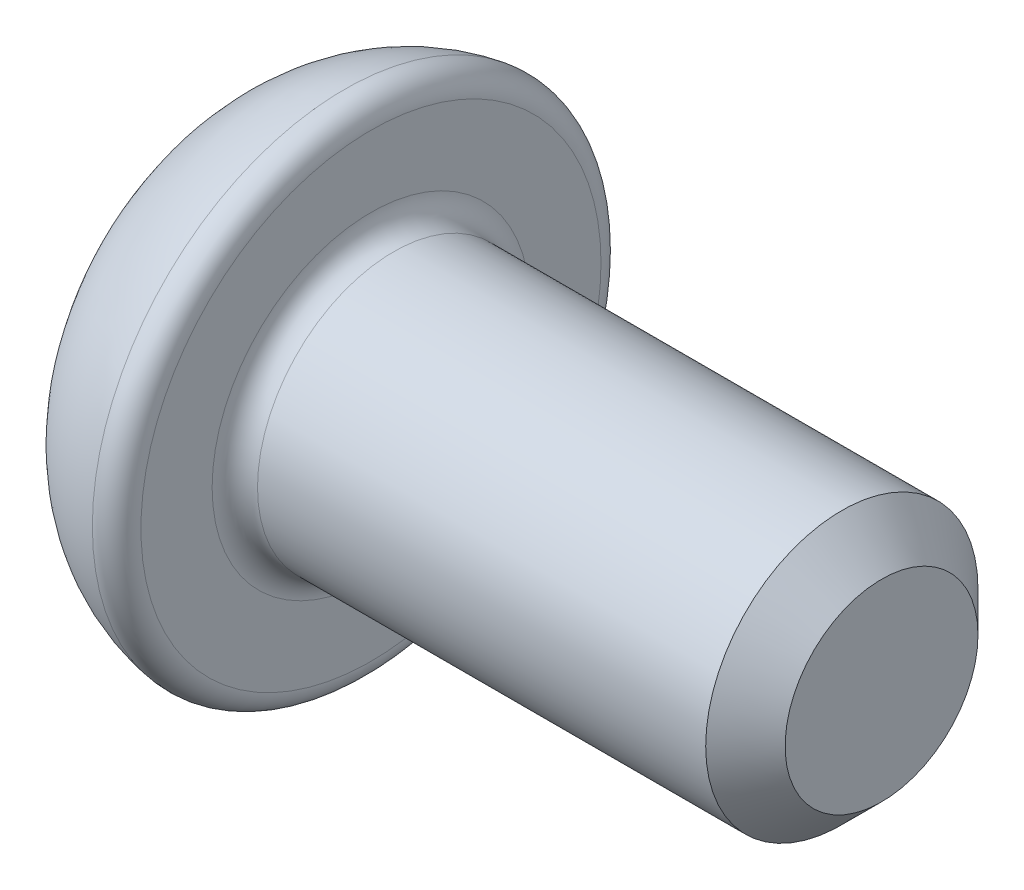
ISO-10303-21;
HEADER;
FILE_DESCRIPTION(('STEP AP214'),'2;1');
FILE_NAME('part.step','',(''),(''),'','','');
FILE_SCHEMA(('AUTOMOTIVE_DESIGN { 1 0 10303 214 1 1 1 1 }'));
ENDSEC;
DATA;
#1=APPLICATION_CONTEXT('core data for automotive mechanical design processes');
#2=APPLICATION_PROTOCOL_DEFINITION('international standard','automotive_design',2000,#1);
#3=PRODUCT_CONTEXT('',#1,'mechanical');
#4=PRODUCT('Part','Part','',(#3));
#5=PRODUCT_RELATED_PRODUCT_CATEGORY('part','',(#4));
#6=PRODUCT_DEFINITION_FORMATION('','',#4);
#7=PRODUCT_DEFINITION_CONTEXT('part definition',#1,'design');
#8=PRODUCT_DEFINITION('design','',#6,#7);
#9=PRODUCT_DEFINITION_SHAPE('','',#8);
#10=(LENGTH_UNIT() NAMED_UNIT(*) SI_UNIT(.MILLI.,.METRE.));
#11=(NAMED_UNIT(*) PLANE_ANGLE_UNIT() SI_UNIT($,.RADIAN.));
#12=(NAMED_UNIT(*) SI_UNIT($,.STERADIAN.) SOLID_ANGLE_UNIT());
#13=UNCERTAINTY_MEASURE_WITH_UNIT(LENGTH_MEASURE(1.E-05),#10,'distance_accuracy_value','');
#14=(GEOMETRIC_REPRESENTATION_CONTEXT(3) GLOBAL_UNCERTAINTY_ASSIGNED_CONTEXT((#13)) GLOBAL_UNIT_ASSIGNED_CONTEXT((#10,
#11,#12)) REPRESENTATION_CONTEXT('',''));
#15=CARTESIAN_POINT('',(0.,0.,0.));
#16=DIRECTION('',(0.,0.,1.));
#17=DIRECTION('',(1.,0.,0.));
#18=AXIS2_PLACEMENT_3D('',#15,#16,#17);
#19=CARTESIAN_POINT('',(1.5,0.,0.));
#20=DIRECTION('',(1.,0.,0.));
#21=DIRECTION('',(0.,0.,-1.));
#22=AXIS2_PLACEMENT_3D('',#19,#20,#21);
#23=DEGENERATE_TOROIDAL_SURFACE('',#22,0.742857779384793,1.5,.T.);
#24=CARTESIAN_POINT('',(0.00507482698011568,-0.866140873838277,-0.000200000000000182));
#25=CARTESIAN_POINT('',(0.00359045454716698,-0.848096714415208,0.0310534009006274));
#26=CARTESIAN_POINT('',(0.00256712460489067,-0.830046186840496,0.0623178317634519));
#27=CARTESIAN_POINT('',(0.00113644894011085,-0.793941421995864,0.124853118869681));
#28=CARTESIAN_POINT('',(0.000729006787376216,-0.775887185749428,0.156123973340361));
#29=CARTESIAN_POINT('',(0.000223771191370331,-0.739781114546436,0.218661523125641));
#30=CARTESIAN_POINT('',(0.000125930777252115,-0.721729279641151,0.249928218351441));
#31=CARTESIAN_POINT('',(2.25448094797791E-05,-0.685624647439826,0.312463275712722));
#32=CARTESIAN_POINT('',(1.70036735102103E-05,-0.667571850139078,0.34373163785636));
#33=CARTESIAN_POINT('',(1.70036735104579E-05,-0.631466255537582,0.406268362143637));
#34=CARTESIAN_POINT('',(2.25448094802742E-05,-0.613413458236834,0.437536724287275));
#35=CARTESIAN_POINT('',(0.000125930777251618,-0.577308826035509,0.500071781648556));
#36=CARTESIAN_POINT('',(0.000223771191368596,-0.559256991130224,0.531338476874356));
#37=CARTESIAN_POINT('',(0.000729006787378057,-0.523150919927233,0.593876026659636));
#38=CARTESIAN_POINT('',(0.0011364489401175,-0.505096683680796,0.625146881130316));
#39=CARTESIAN_POINT('',(0.00256712460488402,-0.468991918836165,0.687682168236544));
#40=CARTESIAN_POINT('',(0.0035904545471422,-0.450941391261452,0.718946599099369));
#41=CARTESIAN_POINT('',(0.00507482698004681,-0.432897231838383,0.750199999999997));
#42=B_SPLINE_CURVE_WITH_KNOTS('',3,(#24,#25,#26,#27,#28,#29,#30,#31,#32,#33,#34,#35,#36,#37,#38,
#39,#40,#41),.UNSPECIFIED.,.F.,.F.,(4,2,2,2,2,2,2,2,4),(0.,0.108344917548004,0.216672869654924,
0.324984386131675,0.433301086665634,0.541617787199592,0.649929303676343,0.758257255783262,
0.866602173331265),.UNSPECIFIED.);
#43=CARTESIAN_POINT('',(0.00506530701247117,-0.866025403784439,0.));
#44=VERTEX_POINT('',#43);
#45=CARTESIAN_POINT('',(0.0050653070118024,-0.433012701892483,0.75));
#46=VERTEX_POINT('',#45);
#47=EDGE_CURVE('E11',#44,#46,#42,.T.);
#48=ORIENTED_EDGE('',*,*,#47,.F.);
#49=CARTESIAN_POINT('',(0.00507482698011564,-0.432897231838381,-0.7502));
#50=CARTESIAN_POINT('',(0.00359045454716716,-0.45094139126145,-0.718946599099373));
#51=CARTESIAN_POINT('',(0.00256712460489088,-0.468991918836162,-0.687682168236548));
#52=CARTESIAN_POINT('',(0.00113644894011098,-0.505096683680794,-0.625146881130319));
#53=CARTESIAN_POINT('',(0.000729006787376246,-0.52315091992723,-0.593876026659639));
#54=CARTESIAN_POINT('',(0.000223771191370313,-0.559256991130222,-0.531338476874359));
#55=CARTESIAN_POINT('',(0.00012593077725215,-0.577308826035507,-0.500071781648559));
#56=CARTESIAN_POINT('',(2.25448094798608E-05,-0.613413458236832,-0.437536724287278));
#57=CARTESIAN_POINT('',(1.70036735102843E-05,-0.63146625553758,-0.40626836214364));
#58=CARTESIAN_POINT('',(1.70036735105024E-05,-0.667571850139076,-0.343731637856363));
#59=CARTESIAN_POINT('',(2.25448094802971E-05,-0.685624647439825,-0.312463275712725));
#60=CARTESIAN_POINT('',(0.000125930777251552,-0.721729279641149,-0.249928218351444));
#61=CARTESIAN_POINT('',(0.000223771191368463,-0.739781114546434,-0.218661523125644));
#62=CARTESIAN_POINT('',(0.000729006787377987,-0.775887185749426,-0.156123973340364));
#63=CARTESIAN_POINT('',(0.00113644894011756,-0.793941421995862,-0.124853118869684));
#64=CARTESIAN_POINT('',(0.00256712460488427,-0.830046186840494,-0.0623178317634558));
#65=CARTESIAN_POINT('',(0.0035904545471425,-0.848096714415206,-0.0310534009006312));
#66=CARTESIAN_POINT('',(0.00507482698004698,-0.866140873838275,0.000199999999997347));
#67=B_SPLINE_CURVE_WITH_KNOTS('',3,(#49,#50,#51,#52,#53,#54,#55,#56,#57,#58,#59,#60,#61,#62,#63,
#64,#65,#66),.UNSPECIFIED.,.F.,.F.,(4,2,2,2,2,2,2,2,4),(0.,0.108344917548004,0.216672869654924,
0.324984386131675,0.433301086665634,0.541617787199592,0.649929303676343,0.758257255783262,
0.866602173331265),.UNSPECIFIED.);
#68=CARTESIAN_POINT('',(0.0050653070117917,-0.433012701892219,-0.75));
#69=VERTEX_POINT('',#68);
#70=EDGE_CURVE('E45',#69,#44,#67,.T.);
#71=ORIENTED_EDGE('',*,*,#70,.F.);
#72=CARTESIAN_POINT('',(1.70038681486596E-05,0.,-0.75));
#73=CARTESIAN_POINT('',(8.51743592983909E-06,-0.0627633217768596,-0.75));
#74=CARTESIAN_POINT('',(-1.03113455063479E-05,-0.125525992433208,-0.75));
#75=CARTESIAN_POINT('',(0.000627242527467483,-0.251072059853545,-0.75));
#76=CARTESIAN_POINT('',(0.001283827899949,-0.313855457182888,-0.75));
#77=CARTESIAN_POINT('',(0.00490838042648395,-0.439085184071889,-0.75));
#78=CARTESIAN_POINT('',(0.00786565683196686,-0.50153173100465,-0.75));
#79=CARTESIAN_POINT('',(0.0177071587947877,-0.626116492855824,-0.75));
#80=CARTESIAN_POINT('',(0.0245892341690586,-0.688254857824042,-0.75));
#81=CARTESIAN_POINT('',(0.0415155784595061,-0.798692756947448,-0.75));
#82=CARTESIAN_POINT('',(0.0505831051340718,-0.84713943543722,-0.75));
#83=CARTESIAN_POINT('',(0.0723422591856666,-0.943225479650236,-0.75));
#84=CARTESIAN_POINT('',(0.0850341045443394,-0.990864796632771,-0.75));
#85=CARTESIAN_POINT('',(0.11432660976382,-1.08498605238059,-0.75));
#86=CARTESIAN_POINT('',(0.130930703499445,-1.13146693450067,-0.75));
#87=CARTESIAN_POINT('',(0.168162086671954,-1.22279101320214,-0.75));
#88=CARTESIAN_POINT('',(0.188790482473608,-1.26763375539039,-0.75));
#89=CARTESIAN_POINT('',(0.257148613384572,-1.39973135669333,-0.75));
#90=CARTESIAN_POINT('',(0.311145354487172,-1.48387272898085,-0.75));
#91=CARTESIAN_POINT('',(0.434634260600086,-1.63988170496729,-0.75));
#92=CARTESIAN_POINT('',(0.5041221370162,-1.71175269591571,-0.75));
#93=CARTESIAN_POINT('',(0.645622857736314,-1.83100909575596,-0.75));
#94=CARTESIAN_POINT('',(0.715944706047727,-1.88040885401691,-0.75));
#95=CARTESIAN_POINT('',(0.864230139523405,-1.96591138864468,-0.75));
#96=CARTESIAN_POINT('',(0.942189107141949,-2.00202213773184,-0.75));
#97=CARTESIAN_POINT('',(1.09903170295814,-2.05813867294692,-0.75));
#98=CARTESIAN_POINT('',(1.17764710098958,-2.07889690281792,-0.75));
#99=CARTESIAN_POINT('',(1.33727194052226,-2.10667801221031,-0.75));
#100=CARTESIAN_POINT('',(1.41828120217651,-2.11370192091861,-0.75));
#101=CARTESIAN_POINT('',(1.57896840697214,-2.1137837773442,-0.75));
#102=CARTESIAN_POINT('',(1.65864634880464,-2.107069360262,-0.75));
#103=CARTESIAN_POINT('',(1.81573283459479,-2.08034710647343,-0.75));
#104=CARTESIAN_POINT('',(1.893141584498,-2.06034048005544,-0.75));
#105=CARTESIAN_POINT('',(2.04347116184536,-2.0076835757952,-0.75));
#106=CARTESIAN_POINT('',(2.11639476419379,-1.97504120859992,-0.75));
#107=CARTESIAN_POINT('',(2.2558295017735,-1.89812909398434,-0.75));
#108=CARTESIAN_POINT('',(2.3223399580604,-1.85385811731472,-0.75));
#109=CARTESIAN_POINT('',(2.44808789023964,-1.75438773947882,-0.75));
#110=CARTESIAN_POINT('',(2.50721297990947,-1.69904664723767,-0.75));
#111=CARTESIAN_POINT('',(2.61574077418286,-1.57950761511114,-0.75));
#112=CARTESIAN_POINT('',(2.6651422131084,-1.51530852407275,-0.75));
#113=CARTESIAN_POINT('',(2.73210437788385,-1.41258388080033,-0.75));
#114=CARTESIAN_POINT('',(2.75356444112419,-1.37653137562612,-0.75));
#115=CARTESIAN_POINT('',(2.79358027903374,-1.30282718798414,-0.75));
#116=CARTESIAN_POINT('',(2.81213523478332,-1.26517505838793,-0.75));
#117=CARTESIAN_POINT('',(2.8462872803208,-1.18863154970814,-0.75));
#118=CARTESIAN_POINT('',(2.86188909539756,-1.14974226868257,-0.75));
#119=CARTESIAN_POINT('',(2.89021327404349,-1.07096505314401,-0.75));
#120=CARTESIAN_POINT('',(2.90293769012191,-1.03107785316841,-0.75));
#121=CARTESIAN_POINT('',(2.92810630612967,-0.941750077111441,-0.75));
#122=CARTESIAN_POINT('',(2.93988502360629,-0.892122034316034,-0.75));
#123=CARTESIAN_POINT('',(2.95970848631281,-0.792117593495101,-0.75));
#124=CARTESIAN_POINT('',(2.96775152039821,-0.741740863411902,-0.75));
#125=CARTESIAN_POINT('',(2.9806558273674,-0.640416521566636,-0.75));
#126=CARTESIAN_POINT('',(2.98550591488156,-0.589467532169723,-0.75));
#127=CARTESIAN_POINT('',(2.9927175917922,-0.487408126763797,-0.75));
#128=CARTESIAN_POINT('',(2.99507920190458,-0.436297712102158,-0.75));
#129=CARTESIAN_POINT('',(2.99823021813243,-0.333423194540739,-0.75));
#130=CARTESIAN_POINT('',(2.99900038368318,-0.281658619279118,-0.75));
#131=CARTESIAN_POINT('',(2.99984649885544,-0.178128583223037,-0.75));
#132=CARTESIAN_POINT('',(2.99992246271802,-0.126363122468527,-0.75));
#133=CARTESIAN_POINT('',(2.99999910167708,-0.0229062873851983,-0.75));
#134=CARTESIAN_POINT('',(2.99999988444028,0.0287850868750269,-0.75));
#135=CARTESIAN_POINT('',(2.9999127515185,0.132166878956575,-0.75));
#136=CARTESIAN_POINT('',(2.99982483699548,0.183857296781557,-0.75));
#137=CARTESIAN_POINT('',(2.99886687845879,0.294188764454439,-0.75));
#138=CARTESIAN_POINT('',(2.99789323654046,0.352829656134544,-0.75));
#139=CARTESIAN_POINT('',(2.99364462342992,0.470047707738772,-0.75));
#140=CARTESIAN_POINT('',(2.99036956918576,0.528624865286489,-0.75));
#141=CARTESIAN_POINT('',(2.98024863796969,0.644974337482931,-0.75));
#142=CARTESIAN_POINT('',(2.97343470464615,0.70274918159311,-0.75));
#143=CARTESIAN_POINT('',(2.95529531111109,0.817584332340795,-0.75));
#144=CARTESIAN_POINT('',(2.9439706358738,0.874644761522053,-0.75));
#145=CARTESIAN_POINT('',(2.90793741757983,1.02072666613938,-0.75));
#146=CARTESIAN_POINT('',(2.87927463883316,1.10883238926374,-0.75));
#147=CARTESIAN_POINT('',(2.80755373177432,1.27941999776596,-0.75));
#148=CARTESIAN_POINT('',(2.76444478586835,1.36188077499496,-0.75));
#149=CARTESIAN_POINT('',(2.6639307480279,1.51815602276155,-0.75));
#150=CARTESIAN_POINT('',(2.60646396138482,1.59193110471903,-0.75));
#151=CARTESIAN_POINT('',(2.47879735915391,1.72736837747299,-0.75));
#152=CARTESIAN_POINT('',(2.40861488215819,1.78904682713848,-0.75));
#153=CARTESIAN_POINT('',(2.2650521680253,1.89258643202531,-0.75));
#154=CARTESIAN_POINT('',(2.19263344628211,1.93578529537787,-0.75));
#155=CARTESIAN_POINT('',(2.04132923785587,2.00882893820167,-0.75));
#156=CARTESIAN_POINT('',(1.96244410776947,2.03867445347141,-0.75));
#157=CARTESIAN_POINT('',(1.80393283331948,2.08304245183995,-0.75));
#158=CARTESIAN_POINT('',(1.72446619791012,2.09813675642112,-0.75));
#159=CARTESIAN_POINT('',(1.56413082189332,2.114583554702,-0.75));
#160=CARTESIAN_POINT('',(1.48326232945652,2.11593845629697,-0.75));
#161=CARTESIAN_POINT('',(1.32348353369065,2.1049362632381,-0.75));
#162=CARTESIAN_POINT('',(1.24456138727285,2.09275004027386,-0.75));
#163=CARTESIAN_POINT('',(1.08987678798967,2.05532499879789,-0.75));
#164=CARTESIAN_POINT('',(1.0141143679926,2.03008604454478,-0.75));
#165=CARTESIAN_POINT('',(0.867697351230119,1.96728005518506,-0.75));
#166=CARTESIAN_POINT('',(0.797054106462812,1.92968658647221,-0.75));
#167=CARTESIAN_POINT('',(0.662953788134306,1.84336792103379,-0.75));
#168=CARTESIAN_POINT('',(0.59949623721197,1.79464346441339,-0.75));
#169=CARTESIAN_POINT('',(0.480306932976312,1.68662496972284,-0.75));
#170=CARTESIAN_POINT('',(0.424728053849731,1.62716245861748,-0.75));
#171=CARTESIAN_POINT('',(0.323825238209526,1.50009054153653,-0.75));
#172=CARTESIAN_POINT('',(0.278506202721976,1.43247726555454,-0.75));
#173=CARTESIAN_POINT('',(0.196933354116028,1.28776152783342,-0.75));
#174=CARTESIAN_POINT('',(0.161205341606327,1.21036252024074,-0.75));
#175=CARTESIAN_POINT('',(0.11659711651685,1.09109821882354,-0.75));
#176=CARTESIAN_POINT('',(0.103229510557901,1.05083702801128,-0.75));
#177=CARTESIAN_POINT('',(0.0793381770252234,0.969483386550849,-0.75));
#178=CARTESIAN_POINT('',(0.0688139703331113,0.928391077203638,-0.75));
#179=CARTESIAN_POINT('',(0.0436064723909326,0.814808050810428,-0.75));
#180=CARTESIAN_POINT('',(0.0316561450486116,0.741707635459897,-0.75));
#181=CARTESIAN_POINT('',(0.0143321244371551,0.594718686177399,-0.75));
#182=CARTESIAN_POINT('',(0.00896675681090083,0.520829273432576,-0.75));
#183=CARTESIAN_POINT('',(0.00233077204771376,0.372429998131146,-0.75));
#184=CARTESIAN_POINT('',(0.00108713805310823,0.297919236043018,-0.75));
#185=CARTESIAN_POINT('',(0.000245163798238408,0.186176636520617,-0.75));
#186=CARTESIAN_POINT('',(0.000134994556698239,0.148941436300744,-0.75));
#187=CARTESIAN_POINT('',(2.3433144874083E-05,0.0744707476474208,-0.75));
#188=CARTESIAN_POINT('',(2.20385682686083E-05,0.0372352592385696,-0.75));
#189=CARTESIAN_POINT('',(1.70038681486596E-05,0.,-0.75));
#190=B_SPLINE_CURVE_WITH_KNOTS('',3,(#72,#73,#74,#75,#76,#77,#78,#79,#80,#81,#82,#83,#84,#85,
#86,#87,#88,#89,#90,#91,#92,#93,#94,#95,#96,#97,#98,#99,#100,#101,#102,#103,#104,#105,#106,#107,
#108,#109,#110,#111,#112,#113,#114,#115,#116,#117,#118,#119,#120,#121,#122,#123,#124,#125,#126,
#127,#128,#129,#130,#131,#132,#133,#134,#135,#136,#137,#138,#139,#140,#141,#142,#143,#144,#145,
#146,#147,#148,#149,#150,#151,#152,#153,#154,#155,#156,#157,#158,#159,#160,#161,#162,#163,#164,
#165,#166,#167,#168,#169,#170,#171,#172,#173,#174,#175,#176,#177,#178,#179,#180,#181,#182,#183,
#184,#185,#186,#187,#188,#189),.UNSPECIFIED.,.T.,.F.,(4,2,2,2,2,2,2,2,2,2,2,2,2,2,2,2,2,2,2,2,2,
2,2,2,2,2,2,2,2,2,2,2,2,2,2,2,2,2,2,2,2,2,2,2,2,2,2,2,2,2,2,2,2,2,2,2,2,2,4),(0.,
0.188289830002197,0.376636189603331,0.564112539352564,0.751486279575727,0.89922777141884,
1.04697815092371,1.19485870079984,1.34277996356985,1.64073070284888,1.93859905910706,
2.19509849854584,2.45144379969721,2.69419620555604,2.93693041996748,3.17567526479684,
3.41439837429904,3.65297227149887,3.89157139827632,4.13344623206421,4.37535252867571,
4.50111101332244,4.6269048844007,4.75249574028438,4.87799672497029,5.03085003656943,
5.18377329434831,5.33722945413379,5.49068433642874,5.64598388453956,5.80128024678374,
5.95635420608918,6.11142613393457,6.28735357673124,6.46328736861564,6.63766000819722,
6.8120023161239,7.08876130378415,7.3665042548098,7.64546181646586,7.92404182723333,
8.17574927157139,8.42744284457361,8.66893906788559,8.91039296711197,9.1488342806816,
9.38727807396221,9.62623539754174,9.86517683734631,10.1082573983482,10.3514538326706,
10.6060736621294,10.7332547128634,10.8604143199552,11.0822005242378,11.3042668542736,
11.527784111226,11.6394922798736,11.7511979773038),.UNSPECIFIED.);
#191=CARTESIAN_POINT('',(0.00506530701177338,0.43301270189222,-0.75));
#192=VERTEX_POINT('',#191);
#193=EDGE_CURVE('E218',#192,#69,#190,.T.);
#194=ORIENTED_EDGE('',*,*,#193,.F.);
#195=CARTESIAN_POINT('',(0.0050748269801157,0.866140873838277,0.000200000000000332));
#196=CARTESIAN_POINT('',(0.00359045454716719,0.848096714415208,-0.0310534009006273));
#197=CARTESIAN_POINT('',(0.00256712460489088,0.830046186840496,-0.0623178317634518));
#198=CARTESIAN_POINT('',(0.00113644894011093,0.793941421995864,-0.124853118869681));
#199=CARTESIAN_POINT('',(0.000729006787376178,0.775887185749428,-0.15612397334036));
#200=CARTESIAN_POINT('',(0.000223771191370226,0.739781114546436,-0.218661523125641));
#201=CARTESIAN_POINT('',(0.000125930777252066,0.721729279641151,-0.249928218351441));
#202=CARTESIAN_POINT('',(2.25448094797368E-05,0.685624647439826,-0.312463275712722));
#203=CARTESIAN_POINT('',(1.70036735101178E-05,0.667571850139078,-0.343731637856361));
#204=CARTESIAN_POINT('',(1.70036735104588E-05,0.631466255537582,-0.406268362143637));
#205=CARTESIAN_POINT('',(2.25448094804188E-05,0.613413458236834,-0.437536724287275));
#206=CARTESIAN_POINT('',(0.000125930777251701,0.577308826035509,-0.500071781648556));
#207=CARTESIAN_POINT('',(0.000223771191368474,0.559256991130224,-0.531338476874356));
#208=CARTESIAN_POINT('',(0.000729006787377915,0.523150919927233,-0.593876026659636));
#209=CARTESIAN_POINT('',(0.00113644894011755,0.505096683680796,-0.625146881130316));
#210=CARTESIAN_POINT('',(0.00256712460488437,0.468991918836165,-0.687682168236544));
#211=CARTESIAN_POINT('',(0.00359045454714267,0.450941391261452,-0.718946599099369));
#212=CARTESIAN_POINT('',(0.00507482698004714,0.432897231838383,-0.750199999999998));
#213=B_SPLINE_CURVE_WITH_KNOTS('',3,(#195,#196,#197,#198,#199,#200,#201,#202,#203,#204,#205,
#206,#207,#208,#209,#210,#211,#212),.UNSPECIFIED.,.F.,.F.,(4,2,2,2,2,2,2,2,4),(0.,
0.108344917548004,0.216672869654924,0.324984386131675,0.433301086665634,0.541617787199592,
0.649929303676344,0.758257255783262,0.866602173331266),.UNSPECIFIED.);
#214=CARTESIAN_POINT('',(0.00506530701177327,0.866025403784439,0.));
#215=VERTEX_POINT('',#214);
#216=EDGE_CURVE('E215',#215,#192,#213,.T.);
#217=ORIENTED_EDGE('',*,*,#216,.F.);
#218=CARTESIAN_POINT('',(0.00507482698011564,0.432897231838382,0.7502));
#219=CARTESIAN_POINT('',(0.00359045454716716,0.450941391261451,0.718946599099372));
#220=CARTESIAN_POINT('',(0.00256712460489087,0.468991918836163,0.687682168236547));
#221=CARTESIAN_POINT('',(0.00113644894011096,0.505096683680795,0.625146881130319));
#222=CARTESIAN_POINT('',(0.00072900678737622,0.523150919927231,0.593876026659639));
#223=CARTESIAN_POINT('',(0.000223771191370289,0.559256991130223,0.531338476874359));
#224=CARTESIAN_POINT('',(0.000125930777252133,0.577308826035508,0.500071781648559));
#225=CARTESIAN_POINT('',(2.25448094798041E-05,0.613413458236833,0.437536724287277));
#226=CARTESIAN_POINT('',(1.70036735101814E-05,0.631466255537581,0.406268362143639));
#227=CARTESIAN_POINT('',(1.70036735105071E-05,0.667571850139077,0.343731637856363));
#228=CARTESIAN_POINT('',(2.25448094804554E-05,0.685624647439825,0.312463275712725));
#229=CARTESIAN_POINT('',(0.000125930777251705,0.72172927964115,0.249928218351444));
#230=CARTESIAN_POINT('',(0.000223771191368458,0.739781114546435,0.218661523125644));
#231=CARTESIAN_POINT('',(0.000729006787377846,0.775887185749426,0.156123973340364));
#232=CARTESIAN_POINT('',(0.00113644894011745,0.793941421995863,0.124853118869684));
#233=CARTESIAN_POINT('',(0.0025671246048842,0.830046186840494,0.0623178317634558));
#234=CARTESIAN_POINT('',(0.00359045454714245,0.848096714415207,0.0310534009006312));
#235=CARTESIAN_POINT('',(0.00507482698004688,0.866140873838276,-0.000199999999997283));
#236=B_SPLINE_CURVE_WITH_KNOTS('',3,(#218,#219,#220,#221,#222,#223,#224,#225,#226,#227,#228,
#229,#230,#231,#232,#233,#234,#235),.UNSPECIFIED.,.F.,.F.,(4,2,2,2,2,2,2,2,4),(0.,
0.108344917548004,0.216672869654924,0.324984386131675,0.433301086665633,0.541617787199592,
0.649929303676343,0.758257255783262,0.866602173331265),.UNSPECIFIED.);
#237=CARTESIAN_POINT('',(0.0050653070117917,0.43301270189222,0.75));
#238=VERTEX_POINT('',#237);
#239=EDGE_CURVE('E152',#238,#215,#236,.T.);
#240=ORIENTED_EDGE('',*,*,#239,.F.);
#241=CARTESIAN_POINT('',(1.70038681486664E-05,0.,0.75));
#242=CARTESIAN_POINT('',(8.5174359298341E-06,0.0627633217768599,0.75));
#243=CARTESIAN_POINT('',(-1.03113455063552E-05,0.125525992433208,0.75));
#244=CARTESIAN_POINT('',(0.000627242527467459,0.251072059853545,0.75));
#245=CARTESIAN_POINT('',(0.00128382789994897,0.313855457182888,0.75));
#246=CARTESIAN_POINT('',(0.00490838042648386,0.439085184071889,0.75));
#247=CARTESIAN_POINT('',(0.00786565683196674,0.50153173100465,0.75));
#248=CARTESIAN_POINT('',(0.0177071587947875,0.626116492855824,0.75));
#249=CARTESIAN_POINT('',(0.0245892341690584,0.688254857824042,0.75));
#250=CARTESIAN_POINT('',(0.0415155784595059,0.798692756947448,0.75));
#251=CARTESIAN_POINT('',(0.0505831051340715,0.84713943543722,0.75));
#252=CARTESIAN_POINT('',(0.0723422591856664,0.943225479650236,0.75));
#253=CARTESIAN_POINT('',(0.0850341045443393,0.99086479663277,0.75));
#254=CARTESIAN_POINT('',(0.11432660976382,1.08498605238059,0.75));
#255=CARTESIAN_POINT('',(0.130930703499444,1.13146693450067,0.75));
#256=CARTESIAN_POINT('',(0.168162086671954,1.22279101320214,0.75));
#257=CARTESIAN_POINT('',(0.188790482473608,1.26763375539039,0.75));
#258=CARTESIAN_POINT('',(0.257148613384572,1.39973135669332,0.75));
#259=CARTESIAN_POINT('',(0.311145354487171,1.48387272898085,0.75));
#260=CARTESIAN_POINT('',(0.434634260600085,1.63988170496729,0.75));
#261=CARTESIAN_POINT('',(0.504122137016199,1.71175269591571,0.75));
#262=CARTESIAN_POINT('',(0.645622857736313,1.83100909575596,0.75));
#263=CARTESIAN_POINT('',(0.715944706047726,1.88040885401691,0.75));
#264=CARTESIAN_POINT('',(0.864230139523403,1.96591138864468,0.75));
#265=CARTESIAN_POINT('',(0.942189107141948,2.00202213773184,0.75));
#266=CARTESIAN_POINT('',(1.09903170295813,2.05813867294692,0.75));
#267=CARTESIAN_POINT('',(1.17764710098958,2.07889690281792,0.75));
#268=CARTESIAN_POINT('',(1.33727194052225,2.10667801221031,0.75));
#269=CARTESIAN_POINT('',(1.41828120217651,2.11370192091861,0.75));
#270=CARTESIAN_POINT('',(1.57896840697214,2.1137837773442,0.75));
#271=CARTESIAN_POINT('',(1.65864634880464,2.107069360262,0.75));
#272=CARTESIAN_POINT('',(1.81573283459479,2.08034710647344,0.75));
#273=CARTESIAN_POINT('',(1.893141584498,2.06034048005544,0.75));
#274=CARTESIAN_POINT('',(2.04347116184535,2.0076835757952,0.75));
#275=CARTESIAN_POINT('',(2.11639476419379,1.97504120859993,0.75));
#276=CARTESIAN_POINT('',(2.2558295017735,1.89812909398434,0.75));
#277=CARTESIAN_POINT('',(2.3223399580604,1.85385811731472,0.75));
#278=CARTESIAN_POINT('',(2.44808789023964,1.75438773947882,0.75));
#279=CARTESIAN_POINT('',(2.50721297990947,1.69904664723767,0.75));
#280=CARTESIAN_POINT('',(2.61574077418286,1.57950761511114,0.75));
#281=CARTESIAN_POINT('',(2.6651422131084,1.51530852407275,0.75));
#282=CARTESIAN_POINT('',(2.73210437788385,1.41258388080033,0.75));
#283=CARTESIAN_POINT('',(2.75356444112419,1.37653137562612,0.75));
#284=CARTESIAN_POINT('',(2.79358027903374,1.30282718798414,0.75));
#285=CARTESIAN_POINT('',(2.81213523478332,1.26517505838793,0.75));
#286=CARTESIAN_POINT('',(2.8462872803208,1.18863154970814,0.75));
#287=CARTESIAN_POINT('',(2.86188909539756,1.14974226868257,0.75));
#288=CARTESIAN_POINT('',(2.89021327404349,1.07096505314401,0.75));
#289=CARTESIAN_POINT('',(2.90293769012191,1.03107785316841,0.75));
#290=CARTESIAN_POINT('',(2.92810630612967,0.941750077111442,0.75));
#291=CARTESIAN_POINT('',(2.93988502360628,0.892122034316036,0.75));
#292=CARTESIAN_POINT('',(2.95970848631281,0.792117593495104,0.75));
#293=CARTESIAN_POINT('',(2.96775152039821,0.741740863411905,0.75));
#294=CARTESIAN_POINT('',(2.9806558273674,0.640416521566639,0.75));
#295=CARTESIAN_POINT('',(2.98550591488156,0.589467532169726,0.75));
#296=CARTESIAN_POINT('',(2.9927175917922,0.487408126763801,0.75));
#297=CARTESIAN_POINT('',(2.99507920190458,0.436297712102162,0.75));
#298=CARTESIAN_POINT('',(2.99823021813243,0.333423194540744,0.75));
#299=CARTESIAN_POINT('',(2.99900038368318,0.281658619279123,0.75));
#300=CARTESIAN_POINT('',(2.99984649885544,0.178128583223042,0.75));
#301=CARTESIAN_POINT('',(2.99992246271802,0.126363122468533,0.75));
#302=CARTESIAN_POINT('',(2.99999910167708,0.0229062873852044,0.75));
#303=CARTESIAN_POINT('',(2.99999988444028,-0.0287850868750208,0.75));
#304=CARTESIAN_POINT('',(2.9999127515185,-0.132166878956568,0.75));
#305=CARTESIAN_POINT('',(2.99982483699548,-0.183857296781549,0.75));
#306=CARTESIAN_POINT('',(2.99886687845879,-0.294188764454432,0.75));
#307=CARTESIAN_POINT('',(2.99789323654046,-0.352829656134537,0.75));
#308=CARTESIAN_POINT('',(2.99364462342992,-0.470047707738767,0.75));
#309=CARTESIAN_POINT('',(2.99036956918576,-0.528624865286484,0.75));
#310=CARTESIAN_POINT('',(2.98024863796969,-0.644974337482927,0.75));
#311=CARTESIAN_POINT('',(2.97343470464615,-0.702749181593107,0.75));
#312=CARTESIAN_POINT('',(2.95529531111109,-0.817584332340792,0.75));
#313=CARTESIAN_POINT('',(2.9439706358738,-0.874644761522051,0.75));
#314=CARTESIAN_POINT('',(2.90793741757983,-1.02072666613938,0.75));
#315=CARTESIAN_POINT('',(2.87927463883316,-1.10883238926374,0.75));
#316=CARTESIAN_POINT('',(2.80755373177432,-1.27941999776596,0.75));
#317=CARTESIAN_POINT('',(2.76444478586835,-1.36188077499495,0.75));
#318=CARTESIAN_POINT('',(2.66393074802791,-1.51815602276155,0.75));
#319=CARTESIAN_POINT('',(2.60646396138482,-1.59193110471903,0.75));
#320=CARTESIAN_POINT('',(2.47879735915391,-1.72736837747299,0.75));
#321=CARTESIAN_POINT('',(2.4086148821582,-1.78904682713848,0.75));
#322=CARTESIAN_POINT('',(2.26505216802531,-1.89258643202531,0.75));
#323=CARTESIAN_POINT('',(2.19263344628211,-1.93578529537787,0.75));
#324=CARTESIAN_POINT('',(2.04132923785588,-2.00882893820167,0.75));
#325=CARTESIAN_POINT('',(1.96244410776948,-2.0386744534714,0.75));
#326=CARTESIAN_POINT('',(1.80393283331948,-2.08304245183995,0.75));
#327=CARTESIAN_POINT('',(1.72446619791013,-2.09813675642112,0.75));
#328=CARTESIAN_POINT('',(1.56413082189332,-2.114583554702,0.75));
#329=CARTESIAN_POINT('',(1.48326232945652,-2.11593845629697,0.75));
#330=CARTESIAN_POINT('',(1.32348353369066,-2.1049362632381,0.75));
#331=CARTESIAN_POINT('',(1.24456138727285,-2.09275004027386,0.75));
#332=CARTESIAN_POINT('',(1.08987678798967,-2.05532499879789,0.75));
#333=CARTESIAN_POINT('',(1.01411436799261,-2.03008604454478,0.75));
#334=CARTESIAN_POINT('',(0.867697351230121,-1.96728005518506,0.75));
#335=CARTESIAN_POINT('',(0.797054106462814,-1.92968658647222,0.75));
#336=CARTESIAN_POINT('',(0.662953788134309,-1.84336792103379,0.75));
#337=CARTESIAN_POINT('',(0.599496237211972,-1.79464346441339,0.75));
#338=CARTESIAN_POINT('',(0.480306932976314,-1.68662496972284,0.75));
#339=CARTESIAN_POINT('',(0.424728053849733,-1.62716245861748,0.75));
#340=CARTESIAN_POINT('',(0.323825238209527,-1.50009054153654,0.75));
#341=CARTESIAN_POINT('',(0.278506202721978,-1.43247726555454,0.75));
#342=CARTESIAN_POINT('',(0.196933354116029,-1.28776152783342,0.75));
#343=CARTESIAN_POINT('',(0.161205341606328,-1.21036252024074,0.75));
#344=CARTESIAN_POINT('',(0.11659711651685,-1.09109821882354,0.75));
#345=CARTESIAN_POINT('',(0.103229510557901,-1.05083702801128,0.75));
#346=CARTESIAN_POINT('',(0.0793381770252236,-0.969483386550851,0.75));
#347=CARTESIAN_POINT('',(0.0688139703331115,-0.92839107720364,0.75));
#348=CARTESIAN_POINT('',(0.0436064723909325,-0.81480805081043,0.75));
#349=CARTESIAN_POINT('',(0.0316561450486117,-0.741707635459898,0.75));
#350=CARTESIAN_POINT('',(0.0143321244371554,-0.594718686177399,0.75));
#351=CARTESIAN_POINT('',(0.00896675681090095,-0.520829273432577,0.75));
#352=CARTESIAN_POINT('',(0.00233077204771373,-0.372429998131147,0.75));
#353=CARTESIAN_POINT('',(0.00108713805310825,-0.297919236043018,0.75));
#354=CARTESIAN_POINT('',(0.000245163798238446,-0.186176636520616,0.75));
#355=CARTESIAN_POINT('',(0.000134994556698275,-0.148941436300743,0.75));
#356=CARTESIAN_POINT('',(2.34331448741071E-05,-0.0744707476474204,0.75));
#357=CARTESIAN_POINT('',(2.2038568268622E-05,-0.0372352592385692,0.75));
#358=CARTESIAN_POINT('',(1.70038681486664E-05,0.,0.75));
#359=B_SPLINE_CURVE_WITH_KNOTS('',3,(#241,#242,#243,#244,#245,#246,#247,#248,#249,#250,#251,
#252,#253,#254,#255,#256,#257,#258,#259,#260,#261,#262,#263,#264,#265,#266,#267,#268,#269,#270,
#271,#272,#273,#274,#275,#276,#277,#278,#279,#280,#281,#282,#283,#284,#285,#286,#287,#288,#289,
#290,#291,#292,#293,#294,#295,#296,#297,#298,#299,#300,#301,#302,#303,#304,#305,#306,#307,#308,
#309,#310,#311,#312,#313,#314,#315,#316,#317,#318,#319,#320,#321,#322,#323,#324,#325,#326,#327,
#328,#329,#330,#331,#332,#333,#334,#335,#336,#337,#338,#339,#340,#341,#342,#343,#344,#345,#346,
#347,#348,#349,#350,#351,#352,#353,#354,#355,#356,#357,#358),.UNSPECIFIED.,.T.,.F.,(4,2,2,2,2,2,
2,2,2,2,2,2,2,2,2,2,2,2,2,2,2,2,2,2,2,2,2,2,2,2,2,2,2,2,2,2,2,2,2,2,2,2,2,2,2,2,2,2,2,2,2,2,2,2,
2,2,2,2,4),(0.,0.188289830002197,0.37663618960333,0.564112539352564,0.751486279575727,
0.899227771418839,1.04697815092371,1.19485870079984,1.34277996356985,1.64073070284888,
1.93859905910705,2.19509849854584,2.45144379969721,2.69419620555604,2.93693041996748,
3.17567526479683,3.41439837429904,3.65297227149887,3.89157139827632,4.13344623206421,
4.3753525286757,4.50111101332244,4.6269048844007,4.75249574028438,4.87799672497028,
5.03085003656943,5.18377329434831,5.33722945413378,5.49068433642873,5.64598388453955,
5.80128024678373,5.95635420608918,6.11142613393456,6.28735357673123,6.46328736861563,
6.63766000819722,6.8120023161239,7.08876130378414,7.3665042548098,7.64546181646585,
7.92404182723332,8.17574927157139,8.42744284457361,8.66893906788559,8.91039296711197,
9.1488342806816,9.38727807396221,9.62623539754173,9.8651768373463,10.1082573983482,
10.3514538326706,10.6060736621294,10.7332547128634,10.8604143199552,11.0822005242378,
11.3042668542736,11.527784111226,11.6394922798736,11.7511979773038),.UNSPECIFIED.);
#360=EDGE_CURVE('E147',#46,#238,#359,.T.);
#361=ORIENTED_EDGE('',*,*,#360,.F.);
#362=EDGE_LOOP('',(#48,#71,#194,#217,#240,#361));
#363=FACE_BOUND('',#362,.T.);
#364=CARTESIAN_POINT('',(1.26923076923077,0.,0.));
#365=DIRECTION('',(1.,0.,0.));
#366=DIRECTION('',(0.,0.,-1.));
#367=AXIS2_PLACEMENT_3D('',#364,#365,#366);
#368=CIRCLE('',#367,2.225);
#369=CARTESIAN_POINT('',(1.26923076923077,0.,-2.225));
#370=VERTEX_POINT('',#369);
#371=EDGE_CURVE('E144',#370,#370,#368,.T.);
#372=ORIENTED_EDGE('',*,*,#371,.F.);
#373=EDGE_LOOP('',(#372));
#374=FACE_BOUND('',#373,.T.);
#375=ADVANCED_FACE('F33',(#363,#374),#23,.T.);
#376=CARTESIAN_POINT('',(1.3,0.,0.));
#377=DIRECTION('',(1.,0.,0.));
#378=DIRECTION('',(0.,0.,-1.));
#379=AXIS2_PLACEMENT_3D('',#376,#377,#378);
#380=TOROIDAL_SURFACE('',#379,2.02738103725131,0.200000000000001);
#381=ORIENTED_EDGE('',*,*,#371,.T.);
#382=EDGE_LOOP('',(#381));
#383=FACE_BOUND('',#382,.T.);
#384=CARTESIAN_POINT('',(1.5,0.,0.));
#385=DIRECTION('',(1.,0.,0.));
#386=DIRECTION('',(0.,0.,-1.));
#387=AXIS2_PLACEMENT_3D('',#384,#385,#386);
#388=CIRCLE('',#387,2.02738103725131);
#389=CARTESIAN_POINT('',(1.5,0.,-2.02738103725131));
#390=VERTEX_POINT('',#389);
#391=EDGE_CURVE('E141',#390,#390,#388,.T.);
#392=ORIENTED_EDGE('',*,*,#391,.F.);
#393=EDGE_LOOP('',(#392));
#394=FACE_BOUND('',#393,.T.);
#395=ADVANCED_FACE('F185',(#383,#394),#380,.T.);
#396=CARTESIAN_POINT('',(1.5,2.02738103725131,0.));
#397=DIRECTION('',(1.,0.,0.));
#398=DIRECTION('',(0.,0.,-1.));
#399=AXIS2_PLACEMENT_3D('',#396,#397,#398);
#400=PLANE('',#399);
#401=ORIENTED_EDGE('',*,*,#391,.T.);
#402=EDGE_LOOP('',(#401));
#403=FACE_BOUND('',#402,.T.);
#404=CARTESIAN_POINT('',(1.5,0.,0.));
#405=DIRECTION('',(1.,0.,0.));
#406=DIRECTION('',(0.,0.,-1.));
#407=AXIS2_PLACEMENT_3D('',#404,#405,#406);
#408=CIRCLE('',#407,1.4);
#409=CARTESIAN_POINT('',(1.5,0.,-1.4));
#410=VERTEX_POINT('',#409);
#411=EDGE_CURVE('E138',#410,#410,#408,.T.);
#412=ORIENTED_EDGE('',*,*,#411,.F.);
#413=EDGE_LOOP('',(#412));
#414=FACE_BOUND('',#413,.T.);
#415=ADVANCED_FACE('F182',(#403,#414),#400,.T.);
#416=CARTESIAN_POINT('',(1.7,0.,0.));
#417=DIRECTION('',(1.,0.,0.));
#418=DIRECTION('',(0.,0.,-1.));
#419=AXIS2_PLACEMENT_3D('',#416,#417,#418);
#420=TOROIDAL_SURFACE('',#419,1.4,0.2);
#421=ORIENTED_EDGE('',*,*,#411,.T.);
#422=EDGE_LOOP('',(#421));
#423=FACE_BOUND('',#422,.T.);
#424=CARTESIAN_POINT('',(1.7,0.,0.));
#425=DIRECTION('',(1.,0.,0.));
#426=DIRECTION('',(0.,0.,-1.));
#427=AXIS2_PLACEMENT_3D('',#424,#425,#426);
#428=CIRCLE('',#427,1.2);
#429=CARTESIAN_POINT('',(1.7,0.,-1.2));
#430=VERTEX_POINT('',#429);
#431=EDGE_CURVE('E135',#430,#430,#428,.T.);
#432=ORIENTED_EDGE('',*,*,#431,.F.);
#433=EDGE_LOOP('',(#432));
#434=FACE_BOUND('',#433,.T.);
#435=ADVANCED_FACE('F178',(#423,#434),#420,.F.);
#436=CARTESIAN_POINT('',(0.,0.,0.));
#437=DIRECTION('',(1.,0.,0.));
#438=DIRECTION('',(0.,0.,-1.));
#439=AXIS2_PLACEMENT_3D('',#436,#437,#438);
#440=CYLINDRICAL_SURFACE('',#439,1.2);
#441=ORIENTED_EDGE('',*,*,#431,.T.);
#442=EDGE_LOOP('',(#441));
#443=FACE_BOUND('',#442,.T.);
#444=CARTESIAN_POINT('',(5.65,0.,0.));
#445=DIRECTION('',(1.,0.,0.));
#446=DIRECTION('',(0.,0.,-1.));
#447=AXIS2_PLACEMENT_3D('',#444,#445,#446);
#448=CIRCLE('',#447,1.2);
#449=CARTESIAN_POINT('',(5.65,0.,-1.2));
#450=VERTEX_POINT('',#449);
#451=EDGE_CURVE('E132',#450,#450,#448,.T.);
#452=ORIENTED_EDGE('',*,*,#451,.F.);
#453=EDGE_LOOP('',(#452));
#454=FACE_BOUND('',#453,.T.);
#455=ADVANCED_FACE('F174',(#443,#454),#440,.T.);
#456=CARTESIAN_POINT('',(6.,0.,0.));
#457=DIRECTION('',(-1.,0.,0.));
#458=DIRECTION('',(0.,0.,1.));
#459=AXIS2_PLACEMENT_3D('',#456,#457,#458);
#460=CONICAL_SURFACE('',#459,0.849999999999998,0.785398163397452);
#461=ORIENTED_EDGE('',*,*,#451,.T.);
#462=EDGE_LOOP('',(#461));
#463=FACE_BOUND('',#462,.T.);
#464=CARTESIAN_POINT('',(6.,0.,0.));
#465=DIRECTION('',(1.,0.,0.));
#466=DIRECTION('',(0.,0.,-1.));
#467=AXIS2_PLACEMENT_3D('',#464,#465,#466);
#468=CIRCLE('',#467,0.849999999999998);
#469=CARTESIAN_POINT('',(6.,0.,-0.849999999999998));
#470=VERTEX_POINT('',#469);
#471=EDGE_CURVE('E120',#470,#470,#468,.T.);
#472=ORIENTED_EDGE('',*,*,#471,.F.);
#473=EDGE_LOOP('',(#472));
#474=FACE_BOUND('',#473,.T.);
#475=ADVANCED_FACE('F170',(#463,#474),#460,.T.);
#476=CARTESIAN_POINT('',(6.,0.849999999999998,0.));
#477=DIRECTION('',(1.,0.,0.));
#478=DIRECTION('',(0.,0.,-1.));
#479=AXIS2_PLACEMENT_3D('',#476,#477,#478);
#480=PLANE('',#479);
#481=ORIENTED_EDGE('',*,*,#471,.T.);
#482=EDGE_LOOP('',(#481));
#483=FACE_BOUND('',#482,.T.);
#484=ADVANCED_FACE('F167',(#483),#480,.T.);
#485=CARTESIAN_POINT('',(0.9,-0.866025403784439,0.));
#486=DIRECTION('',(0.,-0.866025403784439,0.5));
#487=DIRECTION('',(0.,-0.5,-0.866025403784439));
#488=AXIS2_PLACEMENT_3D('',#485,#486,#487);
#489=PLANE('',#488);
#490=ORIENTED_EDGE('',*,*,#47,.T.);
#491=DIRECTION('',(-1.,0.,0.));
#492=VECTOR('',#491,1.);
#493=CARTESIAN_POINT('',(0.9,-0.43301270189222,0.75));
#494=LINE('',#493,#492);
#495=CARTESIAN_POINT('',(0.9,-0.43301270189222,0.75));
#496=VERTEX_POINT('',#495);
#497=EDGE_CURVE('E52',#496,#46,#494,.T.);
#498=ORIENTED_EDGE('',*,*,#497,.F.);
#499=DIRECTION('',(0.,0.5,0.866025403784439));
#500=VECTOR('',#499,1.);
#501=CARTESIAN_POINT('',(0.9,-0.866025403784439,0.));
#502=LINE('',#501,#500);
#503=CARTESIAN_POINT('',(0.9,-0.866025403784439,0.));
#504=VERTEX_POINT('',#503);
#505=EDGE_CURVE('E90',#504,#496,#502,.T.);
#506=ORIENTED_EDGE('',*,*,#505,.F.);
#507=DIRECTION('',(-1.,0.,0.));
#508=VECTOR('',#507,1.);
#509=CARTESIAN_POINT('',(0.9,-0.866025403784439,0.));
#510=LINE('',#509,#508);
#511=EDGE_CURVE('E118',#504,#44,#510,.T.);
#512=ORIENTED_EDGE('',*,*,#511,.T.);
#513=EDGE_LOOP('',(#490,#498,#506,#512));
#514=FACE_BOUND('',#513,.T.);
#515=ADVANCED_FACE('F88',(#514),#489,.F.);
#516=CARTESIAN_POINT('',(0.9,-0.433012701892219,-0.75));
#517=DIRECTION('',(0.,-0.866025403784439,-0.5));
#518=DIRECTION('',(0.,0.5,-0.866025403784439));
#519=AXIS2_PLACEMENT_3D('',#516,#517,#518);
#520=PLANE('',#519);
#521=ORIENTED_EDGE('',*,*,#70,.T.);
#522=ORIENTED_EDGE('',*,*,#511,.F.);
#523=DIRECTION('',(0.,-0.5,0.866025403784438));
#524=VECTOR('',#523,1.);
#525=CARTESIAN_POINT('',(0.9,-0.433012701892219,-0.75));
#526=LINE('',#525,#524);
#527=CARTESIAN_POINT('',(0.9,-0.433012701892219,-0.75));
#528=VERTEX_POINT('',#527);
#529=EDGE_CURVE('E95',#528,#504,#526,.T.);
#530=ORIENTED_EDGE('',*,*,#529,.F.);
#531=DIRECTION('',(-1.,0.,0.));
#532=VECTOR('',#531,1.);
#533=CARTESIAN_POINT('',(0.9,-0.433012701892219,-0.75));
#534=LINE('',#533,#532);
#535=EDGE_CURVE('E121',#528,#69,#534,.T.);
#536=ORIENTED_EDGE('',*,*,#535,.T.);
#537=EDGE_LOOP('',(#521,#522,#530,#536));
#538=FACE_BOUND('',#537,.T.);
#539=ADVANCED_FACE('F166',(#538),#520,.F.);
#540=CARTESIAN_POINT('',(0.9,0.43301270189222,-0.75));
#541=DIRECTION('',(0.,0.,-1.));
#542=DIRECTION('',(0.,1.,0.));
#543=AXIS2_PLACEMENT_3D('',#540,#541,#542);
#544=PLANE('',#543);
#545=ORIENTED_EDGE('',*,*,#193,.T.);
#546=ORIENTED_EDGE('',*,*,#535,.F.);
#547=DIRECTION('',(0.,-1.,0.));
#548=VECTOR('',#547,1.);
#549=CARTESIAN_POINT('',(0.9,0.43301270189222,-0.75));
#550=LINE('',#549,#548);
#551=CARTESIAN_POINT('',(0.9,0.43301270189222,-0.75));
#552=VERTEX_POINT('',#551);
#553=EDGE_CURVE('E115',#552,#528,#550,.T.);
#554=ORIENTED_EDGE('',*,*,#553,.F.);
#555=DIRECTION('',(-1.,0.,0.));
#556=VECTOR('',#555,1.);
#557=CARTESIAN_POINT('',(0.9,0.43301270189222,-0.75));
#558=LINE('',#557,#556);
#559=EDGE_CURVE('E123',#552,#192,#558,.T.);
#560=ORIENTED_EDGE('',*,*,#559,.T.);
#561=EDGE_LOOP('',(#545,#546,#554,#560));
#562=FACE_BOUND('',#561,.T.);
#563=ADVANCED_FACE('F217',(#562),#544,.F.);
#564=CARTESIAN_POINT('',(0.9,0.866025403784439,0.));
#565=DIRECTION('',(0.,0.866025403784439,-0.5));
#566=DIRECTION('',(0.,0.5,0.866025403784439));
#567=AXIS2_PLACEMENT_3D('',#564,#565,#566);
#568=PLANE('',#567);
#569=ORIENTED_EDGE('',*,*,#216,.T.);
#570=ORIENTED_EDGE('',*,*,#559,.F.);
#571=DIRECTION('',(0.,-0.5,-0.866025403784439));
#572=VECTOR('',#571,1.);
#573=CARTESIAN_POINT('',(0.9,0.866025403784439,0.));
#574=LINE('',#573,#572);
#575=CARTESIAN_POINT('',(0.9,0.866025403784439,0.));
#576=VERTEX_POINT('',#575);
#577=EDGE_CURVE('E112',#576,#552,#574,.T.);
#578=ORIENTED_EDGE('',*,*,#577,.F.);
#579=DIRECTION('',(-1.,0.,0.));
#580=VECTOR('',#579,1.);
#581=CARTESIAN_POINT('',(0.9,0.866025403784439,0.));
#582=LINE('',#581,#580);
#583=EDGE_CURVE('E126',#576,#215,#582,.T.);
#584=ORIENTED_EDGE('',*,*,#583,.T.);
#585=EDGE_LOOP('',(#569,#570,#578,#584));
#586=FACE_BOUND('',#585,.T.);
#587=ADVANCED_FACE('F214',(#586),#568,.F.);
#588=CARTESIAN_POINT('',(0.9,0.43301270189222,0.75));
#589=DIRECTION('',(0.,0.866025403784439,0.5));
#590=DIRECTION('',(0.,-0.5,0.866025403784439));
#591=AXIS2_PLACEMENT_3D('',#588,#589,#590);
#592=PLANE('',#591);
#593=ORIENTED_EDGE('',*,*,#239,.T.);
#594=ORIENTED_EDGE('',*,*,#583,.F.);
#595=DIRECTION('',(0.,0.5,-0.866025403784439));
#596=VECTOR('',#595,1.);
#597=CARTESIAN_POINT('',(0.9,0.43301270189222,0.75));
#598=LINE('',#597,#596);
#599=CARTESIAN_POINT('',(0.9,0.43301270189222,0.75));
#600=VERTEX_POINT('',#599);
#601=EDGE_CURVE('E104',#600,#576,#598,.T.);
#602=ORIENTED_EDGE('',*,*,#601,.F.);
#603=DIRECTION('',(-1.,0.,0.));
#604=VECTOR('',#603,1.);
#605=CARTESIAN_POINT('',(0.9,0.43301270189222,0.75));
#606=LINE('',#605,#604);
#607=EDGE_CURVE('E94',#600,#238,#606,.T.);
#608=ORIENTED_EDGE('',*,*,#607,.T.);
#609=EDGE_LOOP('',(#593,#594,#602,#608));
#610=FACE_BOUND('',#609,.T.);
#611=ADVANCED_FACE('F160',(#610),#592,.F.);
#612=CARTESIAN_POINT('',(0.9,-0.43301270189222,0.75));
#613=DIRECTION('',(0.,0.,1.));
#614=DIRECTION('',(1.,0.,0.));
#615=AXIS2_PLACEMENT_3D('',#612,#613,#614);
#616=PLANE('',#615);
#617=ORIENTED_EDGE('',*,*,#360,.T.);
#618=ORIENTED_EDGE('',*,*,#607,.F.);
#619=DIRECTION('',(0.,1.,0.));
#620=VECTOR('',#619,1.);
#621=CARTESIAN_POINT('',(0.9,-0.43301270189222,0.75));
#622=LINE('',#621,#620);
#623=EDGE_CURVE('E98',#496,#600,#622,.T.);
#624=ORIENTED_EDGE('',*,*,#623,.F.);
#625=ORIENTED_EDGE('',*,*,#497,.T.);
#626=EDGE_LOOP('',(#617,#618,#624,#625));
#627=FACE_BOUND('',#626,.T.);
#628=ADVANCED_FACE('F99',(#627),#616,.F.);
#629=CARTESIAN_POINT('',(0.9,0.,0.));
#630=DIRECTION('',(-1.,0.,0.));
#631=DIRECTION('',(0.,0.,1.));
#632=AXIS2_PLACEMENT_3D('',#629,#630,#631);
#633=PLANE('',#632);
#634=ORIENTED_EDGE('',*,*,#505,.T.);
#635=ORIENTED_EDGE('',*,*,#623,.T.);
#636=ORIENTED_EDGE('',*,*,#601,.T.);
#637=ORIENTED_EDGE('',*,*,#577,.T.);
#638=ORIENTED_EDGE('',*,*,#553,.T.);
#639=ORIENTED_EDGE('',*,*,#529,.T.);
#640=EDGE_LOOP('',(#634,#635,#636,#637,#638,#639));
#641=FACE_BOUND('',#640,.T.);
#642=ADVANCED_FACE('F106',(#641),#633,.T.);
#643=CLOSED_SHELL('',(#375,#395,#415,#435,#455,#475,#484,#515,#539,#563,#587,#611,#628,#642));
#644=MANIFOLD_SOLID_BREP('B2',#643);
#645=ADVANCED_BREP_SHAPE_REPRESENTATION('',(#18,#644),#14);
#646=SHAPE_DEFINITION_REPRESENTATION(#9,#645);
ENDSEC;
END-ISO-10303-21;
